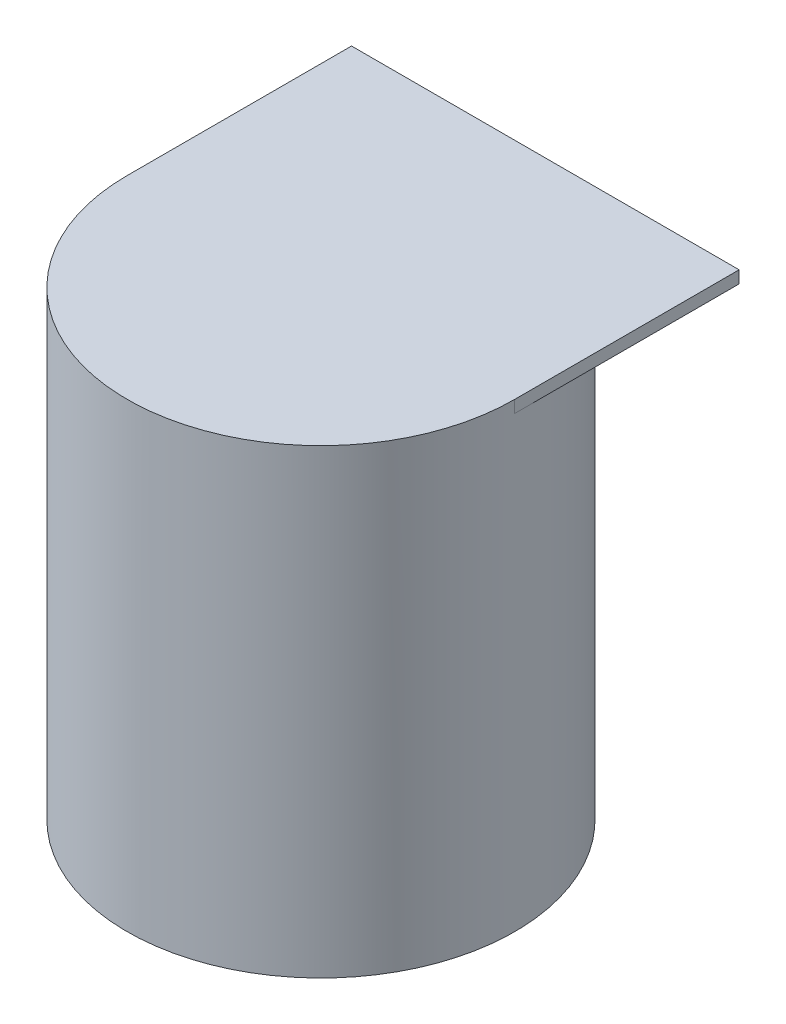
ISO-10303-21;
HEADER;
FILE_DESCRIPTION(('STEP AP214'),'2;1');
FILE_NAME('part.step','',(''),(''),'','','');
FILE_SCHEMA(('AUTOMOTIVE_DESIGN { 1 0 10303 214 1 1 1 1 }'));
ENDSEC;
DATA;
#1=APPLICATION_CONTEXT('core data for automotive mechanical design processes');
#2=APPLICATION_PROTOCOL_DEFINITION('international standard','automotive_design',2000,#1);
#3=PRODUCT_CONTEXT('',#1,'mechanical');
#4=PRODUCT('Part','Part','',(#3));
#5=PRODUCT_RELATED_PRODUCT_CATEGORY('part','',(#4));
#6=PRODUCT_DEFINITION_FORMATION('','',#4);
#7=PRODUCT_DEFINITION_CONTEXT('part definition',#1,'design');
#8=PRODUCT_DEFINITION('design','',#6,#7);
#9=PRODUCT_DEFINITION_SHAPE('','',#8);
#10=(LENGTH_UNIT() NAMED_UNIT(*) SI_UNIT(.MILLI.,.METRE.));
#11=(NAMED_UNIT(*) PLANE_ANGLE_UNIT() SI_UNIT($,.RADIAN.));
#12=(NAMED_UNIT(*) SI_UNIT($,.STERADIAN.) SOLID_ANGLE_UNIT());
#13=UNCERTAINTY_MEASURE_WITH_UNIT(LENGTH_MEASURE(1.E-05),#10,'distance_accuracy_value','');
#14=(GEOMETRIC_REPRESENTATION_CONTEXT(3) GLOBAL_UNCERTAINTY_ASSIGNED_CONTEXT((#13)) GLOBAL_UNIT_ASSIGNED_CONTEXT((#10,
#11,#12)) REPRESENTATION_CONTEXT('',''));
#15=CARTESIAN_POINT('',(0.,0.,0.));
#16=DIRECTION('',(0.,0.,1.));
#17=DIRECTION('',(1.,0.,0.));
#18=AXIS2_PLACEMENT_3D('',#15,#16,#17);
#19=CARTESIAN_POINT('',(0.,27.94,-6.985));
#20=DIRECTION('',(0.,1.,0.));
#21=DIRECTION('',(0.,0.,1.));
#22=AXIS2_PLACEMENT_3D('',#19,#20,#21);
#23=PLANE('',#22);
#24=CARTESIAN_POINT('',(0.,27.94,0.));
#25=DIRECTION('',(0.,1.,0.));
#26=DIRECTION('',(1.,0.,0.));
#27=AXIS2_PLACEMENT_3D('',#24,#25,#26);
#28=CIRCLE('',#27,12.065);
#29=CARTESIAN_POINT('',(12.065,27.94,0.));
#30=VERTEX_POINT('',#29);
#31=CARTESIAN_POINT('',(-12.065,27.94,0.));
#32=VERTEX_POINT('',#31);
#33=EDGE_CURVE('E11',#30,#32,#28,.T.);
#34=ORIENTED_EDGE('',*,*,#33,.T.);
#35=DIRECTION('',(0.,0.,-1.));
#36=VECTOR('',#35,1.);
#37=CARTESIAN_POINT('',(-12.065,27.94,0.));
#38=LINE('',#37,#36);
#39=CARTESIAN_POINT('',(-12.065,27.94,-13.97));
#40=VERTEX_POINT('',#39);
#41=EDGE_CURVE('E26',#32,#40,#38,.T.);
#42=ORIENTED_EDGE('',*,*,#41,.T.);
#43=DIRECTION('',(1.,0.,0.));
#44=VECTOR('',#43,1.);
#45=CARTESIAN_POINT('',(-12.065,27.94,-13.97));
#46=LINE('',#45,#44);
#47=CARTESIAN_POINT('',(12.065,27.94,-13.97));
#48=VERTEX_POINT('',#47);
#49=EDGE_CURVE('E78',#40,#48,#46,.T.);
#50=ORIENTED_EDGE('',*,*,#49,.T.);
#51=DIRECTION('',(0.,0.,1.));
#52=VECTOR('',#51,1.);
#53=CARTESIAN_POINT('',(12.065,27.94,-13.97));
#54=LINE('',#53,#52);
#55=EDGE_CURVE('E80',#48,#30,#54,.T.);
#56=ORIENTED_EDGE('',*,*,#55,.T.);
#57=EDGE_LOOP('',(#34,#42,#50,#56));
#58=FACE_BOUND('',#57,.T.);
#59=ADVANCED_FACE('F16',(#58),#23,.F.);
#60=CARTESIAN_POINT('',(12.065,27.94,0.));
#61=DIRECTION('',(1.,0.,0.));
#62=DIRECTION('',(0.,0.,-1.));
#63=AXIS2_PLACEMENT_3D('',#60,#61,#62);
#64=PLANE('',#63);
#65=ORIENTED_EDGE('',*,*,#55,.F.);
#66=DIRECTION('',(0.,1.,0.));
#67=VECTOR('',#66,1.);
#68=CARTESIAN_POINT('',(12.065,27.94,-13.97));
#69=LINE('',#68,#67);
#70=CARTESIAN_POINT('',(12.065,28.702,-13.97));
#71=VERTEX_POINT('',#70);
#72=EDGE_CURVE('E88',#48,#71,#69,.T.);
#73=ORIENTED_EDGE('',*,*,#72,.T.);
#74=DIRECTION('',(0.,0.,-1.));
#75=VECTOR('',#74,1.);
#76=CARTESIAN_POINT('',(12.065,28.702,-13.97));
#77=LINE('',#76,#75);
#78=CARTESIAN_POINT('',(12.065,28.702,0.));
#79=VERTEX_POINT('',#78);
#80=EDGE_CURVE('E77',#79,#71,#77,.T.);
#81=ORIENTED_EDGE('',*,*,#80,.F.);
#82=DIRECTION('',(0.,1.,0.));
#83=VECTOR('',#82,1.);
#84=CARTESIAN_POINT('',(12.065,27.94,0.));
#85=LINE('',#84,#83);
#86=EDGE_CURVE('E63',#30,#79,#85,.T.);
#87=ORIENTED_EDGE('',*,*,#86,.F.);
#88=EDGE_LOOP('',(#65,#73,#81,#87));
#89=FACE_BOUND('',#88,.T.);
#90=ADVANCED_FACE('F18',(#89),#64,.T.);
#91=CARTESIAN_POINT('',(-12.065,27.94,-13.97));
#92=DIRECTION('',(-1.,0.,0.));
#93=DIRECTION('',(0.,0.,1.));
#94=AXIS2_PLACEMENT_3D('',#91,#92,#93);
#95=PLANE('',#94);
#96=ORIENTED_EDGE('',*,*,#41,.F.);
#97=DIRECTION('',(0.,-1.,0.));
#98=VECTOR('',#97,1.);
#99=CARTESIAN_POINT('',(-12.065,27.94,0.));
#100=LINE('',#99,#98);
#101=CARTESIAN_POINT('',(-12.065,28.702,0.));
#102=VERTEX_POINT('',#101);
#103=EDGE_CURVE('E57',#102,#32,#100,.T.);
#104=ORIENTED_EDGE('',*,*,#103,.F.);
#105=DIRECTION('',(0.,0.,1.));
#106=VECTOR('',#105,1.);
#107=CARTESIAN_POINT('',(-12.065,28.702,0.));
#108=LINE('',#107,#106);
#109=CARTESIAN_POINT('',(-12.065,28.702,-13.97));
#110=VERTEX_POINT('',#109);
#111=EDGE_CURVE('E72',#110,#102,#108,.T.);
#112=ORIENTED_EDGE('',*,*,#111,.F.);
#113=DIRECTION('',(0.,1.,0.));
#114=VECTOR('',#113,1.);
#115=CARTESIAN_POINT('',(-12.065,27.94,-13.97));
#116=LINE('',#115,#114);
#117=EDGE_CURVE('E94',#40,#110,#116,.T.);
#118=ORIENTED_EDGE('',*,*,#117,.F.);
#119=EDGE_LOOP('',(#96,#104,#112,#118));
#120=FACE_BOUND('',#119,.T.);
#121=ADVANCED_FACE('F113',(#120),#95,.T.);
#122=CARTESIAN_POINT('',(12.065,27.94,-13.97));
#123=DIRECTION('',(0.,0.,-1.));
#124=DIRECTION('',(-1.,0.,0.));
#125=AXIS2_PLACEMENT_3D('',#122,#123,#124);
#126=PLANE('',#125);
#127=ORIENTED_EDGE('',*,*,#49,.F.);
#128=ORIENTED_EDGE('',*,*,#117,.T.);
#129=DIRECTION('',(-1.,0.,0.));
#130=VECTOR('',#129,1.);
#131=CARTESIAN_POINT('',(-12.065,28.702,-13.97));
#132=LINE('',#131,#130);
#133=EDGE_CURVE('E74',#71,#110,#132,.T.);
#134=ORIENTED_EDGE('',*,*,#133,.F.);
#135=ORIENTED_EDGE('',*,*,#72,.F.);
#136=EDGE_LOOP('',(#127,#128,#134,#135));
#137=FACE_BOUND('',#136,.T.);
#138=ADVANCED_FACE('F112',(#137),#126,.T.);
#139=CARTESIAN_POINT('',(0.,28.702,-6.985));
#140=DIRECTION('',(0.,1.,0.));
#141=DIRECTION('',(0.,0.,1.));
#142=AXIS2_PLACEMENT_3D('',#139,#140,#141);
#143=PLANE('',#142);
#144=ORIENTED_EDGE('',*,*,#80,.T.);
#145=ORIENTED_EDGE('',*,*,#133,.T.);
#146=ORIENTED_EDGE('',*,*,#111,.T.);
#147=CARTESIAN_POINT('',(0.,28.702,0.));
#148=DIRECTION('',(0.,1.,0.));
#149=DIRECTION('',(-1.,0.,0.));
#150=AXIS2_PLACEMENT_3D('',#147,#148,#149);
#151=CIRCLE('',#150,12.065);
#152=EDGE_CURVE('E68',#102,#79,#151,.T.);
#153=ORIENTED_EDGE('',*,*,#152,.T.);
#154=EDGE_LOOP('',(#144,#145,#146,#153));
#155=FACE_BOUND('',#154,.T.);
#156=ADVANCED_FACE('F106',(#155),#143,.T.);
#157=CARTESIAN_POINT('',(0.,0.,0.));
#158=DIRECTION('',(0.,-1.,0.));
#159=DIRECTION('',(1.,0.,0.));
#160=AXIS2_PLACEMENT_3D('',#157,#158,#159);
#161=CYLINDRICAL_SURFACE('',#160,12.065);
#162=ORIENTED_EDGE('',*,*,#33,.F.);
#163=ORIENTED_EDGE('',*,*,#86,.T.);
#164=ORIENTED_EDGE('',*,*,#152,.F.);
#165=ORIENTED_EDGE('',*,*,#103,.T.);
#166=EDGE_LOOP('',(#162,#163,#164,#165));
#167=FACE_BOUND('',#166,.T.);
#168=CARTESIAN_POINT('',(0.,0.,0.));
#169=DIRECTION('',(0.,-1.,0.));
#170=DIRECTION('',(1.,0.,0.));
#171=AXIS2_PLACEMENT_3D('',#168,#169,#170);
#172=CIRCLE('',#171,12.065);
#173=CARTESIAN_POINT('',(-12.065,0.,0.));
#174=VERTEX_POINT('',#173);
#175=EDGE_CURVE('E20',#174,#174,#172,.T.);
#176=ORIENTED_EDGE('',*,*,#175,.F.);
#177=EDGE_LOOP('',(#176));
#178=FACE_BOUND('',#177,.T.);
#179=ADVANCED_FACE('F54',(#167,#178),#161,.T.);
#180=CARTESIAN_POINT('',(0.,0.,0.));
#181=DIRECTION('',(0.,1.,0.));
#182=DIRECTION('',(0.,0.,1.));
#183=AXIS2_PLACEMENT_3D('',#180,#181,#182);
#184=PLANE('',#183);
#185=ORIENTED_EDGE('',*,*,#175,.T.);
#186=EDGE_LOOP('',(#185));
#187=FACE_BOUND('',#186,.T.);
#188=ADVANCED_FACE('F129',(#187),#184,.F.);
#189=CLOSED_SHELL('',(#59,#90,#121,#138,#156,#179,#188));
#190=MANIFOLD_SOLID_BREP('B1',#189);
#191=ADVANCED_BREP_SHAPE_REPRESENTATION('',(#18,#190),#14);
#192=SHAPE_DEFINITION_REPRESENTATION(#9,#191);
ENDSEC;
END-ISO-10303-21;
